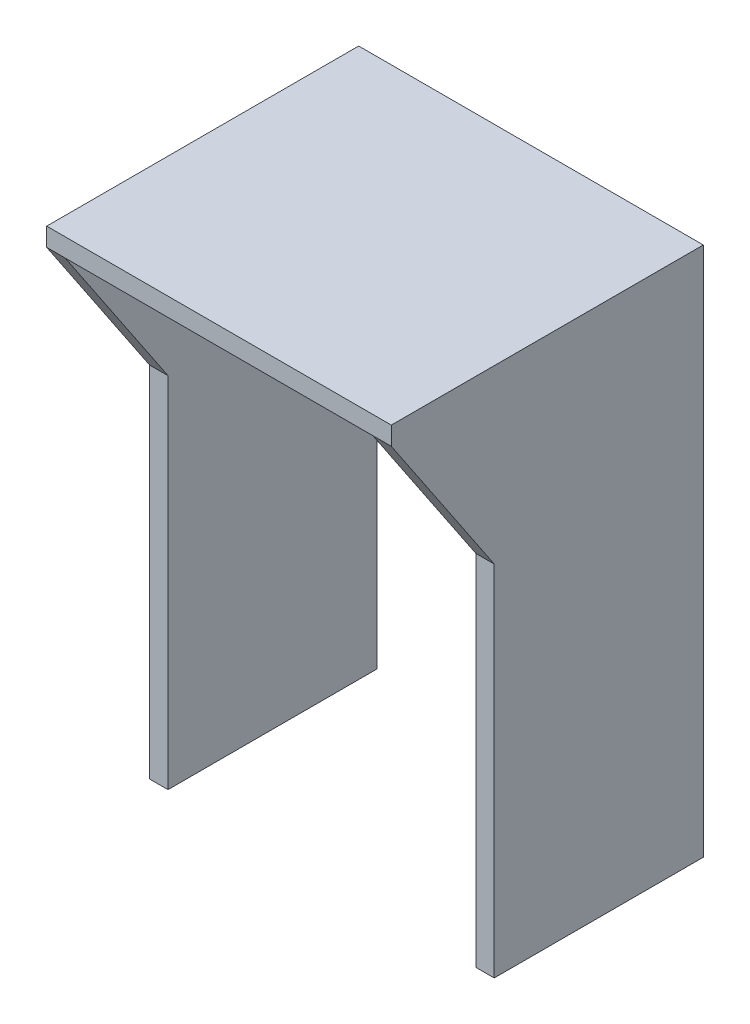
ISO-10303-21;
HEADER;
FILE_DESCRIPTION(('STEP AP214'),'2;1');
FILE_NAME('part.step','',(''),(''),'','','');
FILE_SCHEMA(('AUTOMOTIVE_DESIGN { 1 0 10303 214 1 1 1 1 }'));
ENDSEC;
DATA;
#1=APPLICATION_CONTEXT('core data for automotive mechanical design processes');
#2=APPLICATION_PROTOCOL_DEFINITION('international standard','automotive_design',2000,#1);
#3=PRODUCT_CONTEXT('',#1,'mechanical');
#4=PRODUCT('Part','Part','',(#3));
#5=PRODUCT_RELATED_PRODUCT_CATEGORY('part','',(#4));
#6=PRODUCT_DEFINITION_FORMATION('','',#4);
#7=PRODUCT_DEFINITION_CONTEXT('part definition',#1,'design');
#8=PRODUCT_DEFINITION('design','',#6,#7);
#9=PRODUCT_DEFINITION_SHAPE('','',#8);
#10=(LENGTH_UNIT() NAMED_UNIT(*) SI_UNIT(.MILLI.,.METRE.));
#11=(NAMED_UNIT(*) PLANE_ANGLE_UNIT() SI_UNIT($,.RADIAN.));
#12=(NAMED_UNIT(*) SI_UNIT($,.STERADIAN.) SOLID_ANGLE_UNIT());
#13=UNCERTAINTY_MEASURE_WITH_UNIT(LENGTH_MEASURE(1.E-05),#10,'distance_accuracy_value','');
#14=(GEOMETRIC_REPRESENTATION_CONTEXT(3) GLOBAL_UNCERTAINTY_ASSIGNED_CONTEXT((#13)) GLOBAL_UNIT_ASSIGNED_CONTEXT((#10,
#11,#12)) REPRESENTATION_CONTEXT('',''));
#15=CARTESIAN_POINT('',(0.,0.,0.));
#16=DIRECTION('',(0.,0.,1.));
#17=DIRECTION('',(1.,0.,0.));
#18=AXIS2_PLACEMENT_3D('',#15,#16,#17);
#19=CARTESIAN_POINT('',(41.2,42.8671094972797,25.));
#20=DIRECTION('',(0.,-0.557146091245593,0.830414494701144));
#21=DIRECTION('',(0.,-0.830414494701144,-0.557146091245593));
#22=AXIS2_PLACEMENT_3D('',#19,#20,#21);
#23=PLANE('',#22);
#24=DIRECTION('',(-1.,0.,0.));
#25=VECTOR('',#24,1.);
#26=CARTESIAN_POINT('',(41.2,42.8671094972797,25.));
#27=LINE('',#26,#25);
#28=CARTESIAN_POINT('',(2.2,42.8671094972797,25.));
#29=VERTEX_POINT('',#28);
#30=CARTESIAN_POINT('',(0.,42.8671094972797,25.));
#31=VERTEX_POINT('',#30);
#32=EDGE_CURVE('E123',#29,#31,#27,.T.);
#33=ORIENTED_EDGE('',*,*,#32,.F.);
#34=DIRECTION('',(0.,0.830414494701144,0.557146091245593));
#35=VECTOR('',#34,1.);
#36=CARTESIAN_POINT('',(2.2,42.8671094972797,25.));
#37=LINE('',#36,#35);
#38=CARTESIAN_POINT('',(2.2,61.2000000000008,37.3000000000024));
#39=VERTEX_POINT('',#38);
#40=EDGE_CURVE('E177',#29,#39,#37,.T.);
#41=ORIENTED_EDGE('',*,*,#40,.T.);
#42=DIRECTION('',(-1.,0.,0.));
#43=VECTOR('',#42,1.);
#44=CARTESIAN_POINT('',(41.2,61.2,37.3));
#45=LINE('',#44,#43);
#46=CARTESIAN_POINT('',(0.,61.2,37.3));
#47=VERTEX_POINT('',#46);
#48=EDGE_CURVE('E47',#39,#47,#45,.T.);
#49=ORIENTED_EDGE('',*,*,#48,.T.);
#50=DIRECTION('',(0.,0.830414494701144,0.557146091245593));
#51=VECTOR('',#50,1.);
#52=CARTESIAN_POINT('',(0.,42.8671094972797,25.));
#53=LINE('',#52,#51);
#54=EDGE_CURVE('E161',#31,#47,#53,.T.);
#55=ORIENTED_EDGE('',*,*,#54,.F.);
#56=EDGE_LOOP('',(#33,#41,#49,#55));
#57=FACE_BOUND('',#56,.T.);
#58=ADVANCED_FACE('F38',(#57),#23,.T.);
#59=CARTESIAN_POINT('',(41.2,61.2,37.3));
#60=VERTEX_POINT('',#59);
#61=CARTESIAN_POINT('',(39.,61.2000000000008,37.3000000000024));
#62=VERTEX_POINT('',#61);
#63=EDGE_CURVE('E11',#60,#62,#45,.T.);
#64=ORIENTED_EDGE('',*,*,#63,.T.);
#65=DIRECTION('',(0.,-0.830414494701144,-0.557146091245593));
#66=VECTOR('',#65,1.);
#67=CARTESIAN_POINT('',(39.,42.8671094972797,25.));
#68=LINE('',#67,#66);
#69=CARTESIAN_POINT('',(39.,42.8671094972797,25.));
#70=VERTEX_POINT('',#69);
#71=EDGE_CURVE('E188',#62,#70,#68,.T.);
#72=ORIENTED_EDGE('',*,*,#71,.T.);
#73=CARTESIAN_POINT('',(41.2,42.8671094972797,25.));
#74=VERTEX_POINT('',#73);
#75=EDGE_CURVE('E165',#74,#70,#27,.T.);
#76=ORIENTED_EDGE('',*,*,#75,.F.);
#77=DIRECTION('',(0.,0.830414494701144,0.557146091245593));
#78=VECTOR('',#77,1.);
#79=CARTESIAN_POINT('',(41.2,42.8671094972797,25.));
#80=LINE('',#79,#78);
#81=EDGE_CURVE('E133',#74,#60,#80,.T.);
#82=ORIENTED_EDGE('',*,*,#81,.T.);
#83=EDGE_LOOP('',(#64,#72,#76,#82));
#84=FACE_BOUND('',#83,.T.);
#85=ADVANCED_FACE('F248',(#84),#23,.T.);
#86=CARTESIAN_POINT('',(41.2,0.,25.));
#87=DIRECTION('',(0.,0.,1.));
#88=DIRECTION('',(1.,0.,0.));
#89=AXIS2_PLACEMENT_3D('',#86,#87,#88);
#90=PLANE('',#89);
#91=DIRECTION('',(-1.,0.,0.));
#92=VECTOR('',#91,1.);
#93=CARTESIAN_POINT('',(41.2,0.,25.));
#94=LINE('',#93,#92);
#95=CARTESIAN_POINT('',(2.20000000000001,0.,25.0000000000004));
#96=VERTEX_POINT('',#95);
#97=CARTESIAN_POINT('',(0.,0.,25.));
#98=VERTEX_POINT('',#97);
#99=EDGE_CURVE('E124',#96,#98,#94,.T.);
#100=ORIENTED_EDGE('',*,*,#99,.F.);
#101=DIRECTION('',(0.,1.,0.));
#102=VECTOR('',#101,1.);
#103=CARTESIAN_POINT('',(2.20000000000001,0.,25.));
#104=LINE('',#103,#102);
#105=EDGE_CURVE('E183',#96,#29,#104,.T.);
#106=ORIENTED_EDGE('',*,*,#105,.T.);
#107=ORIENTED_EDGE('',*,*,#32,.T.);
#108=DIRECTION('',(0.,1.,0.));
#109=VECTOR('',#108,1.);
#110=CARTESIAN_POINT('',(0.,0.,25.));
#111=LINE('',#110,#109);
#112=EDGE_CURVE('E158',#98,#31,#111,.T.);
#113=ORIENTED_EDGE('',*,*,#112,.F.);
#114=EDGE_LOOP('',(#100,#106,#107,#113));
#115=FACE_BOUND('',#114,.T.);
#116=ADVANCED_FACE('F181',(#115),#90,.T.);
#117=ORIENTED_EDGE('',*,*,#75,.T.);
#118=DIRECTION('',(0.,-1.,0.));
#119=VECTOR('',#118,1.);
#120=CARTESIAN_POINT('',(39.,0.,25.));
#121=LINE('',#120,#119);
#122=CARTESIAN_POINT('',(39.,0.,25.0000000000004));
#123=VERTEX_POINT('',#122);
#124=EDGE_CURVE('E119',#70,#123,#121,.T.);
#125=ORIENTED_EDGE('',*,*,#124,.T.);
#126=CARTESIAN_POINT('',(41.2,0.,25.));
#127=VERTEX_POINT('',#126);
#128=EDGE_CURVE('E111',#127,#123,#94,.T.);
#129=ORIENTED_EDGE('',*,*,#128,.F.);
#130=DIRECTION('',(0.,1.,0.));
#131=VECTOR('',#130,1.);
#132=CARTESIAN_POINT('',(41.2,0.,25.));
#133=LINE('',#132,#131);
#134=EDGE_CURVE('E115',#127,#74,#133,.T.);
#135=ORIENTED_EDGE('',*,*,#134,.T.);
#136=EDGE_LOOP('',(#117,#125,#129,#135));
#137=FACE_BOUND('',#136,.T.);
#138=ADVANCED_FACE('F114',(#137),#90,.T.);
#139=CARTESIAN_POINT('',(41.2,0.,0.));
#140=DIRECTION('',(0.,-1.,0.));
#141=DIRECTION('',(0.,0.,-1.));
#142=AXIS2_PLACEMENT_3D('',#139,#140,#141);
#143=PLANE('',#142);
#144=DIRECTION('',(-1.,0.,0.));
#145=VECTOR('',#144,1.);
#146=CARTESIAN_POINT('',(41.2,0.,0.));
#147=LINE('',#146,#145);
#148=CARTESIAN_POINT('',(2.20000000000001,0.,0.));
#149=VERTEX_POINT('',#148);
#150=CARTESIAN_POINT('',(0.,0.,0.));
#151=VERTEX_POINT('',#150);
#152=EDGE_CURVE('E167',#149,#151,#147,.T.);
#153=ORIENTED_EDGE('',*,*,#152,.F.);
#154=DIRECTION('',(0.,0.,-1.));
#155=VECTOR('',#154,1.);
#156=CARTESIAN_POINT('',(2.20000000000001,0.,10000.));
#157=LINE('',#156,#155);
#158=EDGE_CURVE('E206',#96,#149,#157,.T.);
#159=ORIENTED_EDGE('',*,*,#158,.F.);
#160=ORIENTED_EDGE('',*,*,#99,.T.);
#161=DIRECTION('',(0.,0.,1.));
#162=VECTOR('',#161,1.);
#163=CARTESIAN_POINT('',(0.,0.,0.));
#164=LINE('',#163,#162);
#165=EDGE_CURVE('E155',#151,#98,#164,.T.);
#166=ORIENTED_EDGE('',*,*,#165,.F.);
#167=EDGE_LOOP('',(#153,#159,#160,#166));
#168=FACE_BOUND('',#167,.T.);
#169=ADVANCED_FACE('F204',(#168),#143,.T.);
#170=ORIENTED_EDGE('',*,*,#128,.T.);
#171=DIRECTION('',(0.,0.,-1.));
#172=VECTOR('',#171,1.);
#173=CARTESIAN_POINT('',(39.,0.,10000.));
#174=LINE('',#173,#172);
#175=CARTESIAN_POINT('',(39.,0.,0.));
#176=VERTEX_POINT('',#175);
#177=EDGE_CURVE('E211',#123,#176,#174,.T.);
#178=ORIENTED_EDGE('',*,*,#177,.T.);
#179=CARTESIAN_POINT('',(41.2,0.,0.));
#180=VERTEX_POINT('',#179);
#181=EDGE_CURVE('E137',#180,#176,#147,.T.);
#182=ORIENTED_EDGE('',*,*,#181,.F.);
#183=DIRECTION('',(0.,0.,1.));
#184=VECTOR('',#183,1.);
#185=CARTESIAN_POINT('',(41.2,0.,0.));
#186=LINE('',#185,#184);
#187=EDGE_CURVE('E130',#180,#127,#186,.T.);
#188=ORIENTED_EDGE('',*,*,#187,.T.);
#189=EDGE_LOOP('',(#170,#178,#182,#188));
#190=FACE_BOUND('',#189,.T.);
#191=ADVANCED_FACE('F135',(#190),#143,.T.);
#192=CARTESIAN_POINT('',(41.2,63.4,0.));
#193=DIRECTION('',(0.,0.,-1.));
#194=DIRECTION('',(-1.,0.,0.));
#195=AXIS2_PLACEMENT_3D('',#192,#193,#194);
#196=PLANE('',#195);
#197=DIRECTION('',(-1.,0.,0.));
#198=VECTOR('',#197,1.);
#199=CARTESIAN_POINT('',(39.,61.2,0.));
#200=LINE('',#199,#198);
#201=CARTESIAN_POINT('',(39.,61.2,0.));
#202=VERTEX_POINT('',#201);
#203=CARTESIAN_POINT('',(2.2,61.2,0.));
#204=VERTEX_POINT('',#203);
#205=EDGE_CURVE('E55',#202,#204,#200,.T.);
#206=ORIENTED_EDGE('',*,*,#205,.T.);
#207=DIRECTION('',(0.,-1.,0.));
#208=VECTOR('',#207,1.);
#209=CARTESIAN_POINT('',(2.2,61.2,0.));
#210=LINE('',#209,#208);
#211=EDGE_CURVE('E220',#204,#149,#210,.T.);
#212=ORIENTED_EDGE('',*,*,#211,.T.);
#213=ORIENTED_EDGE('',*,*,#152,.T.);
#214=DIRECTION('',(0.,-1.,0.));
#215=VECTOR('',#214,1.);
#216=CARTESIAN_POINT('',(0.,63.4,0.));
#217=LINE('',#216,#215);
#218=CARTESIAN_POINT('',(0.,63.4,0.));
#219=VERTEX_POINT('',#218);
#220=EDGE_CURVE('E152',#219,#151,#217,.T.);
#221=ORIENTED_EDGE('',*,*,#220,.F.);
#222=DIRECTION('',(-1.,0.,0.));
#223=VECTOR('',#222,1.);
#224=CARTESIAN_POINT('',(41.2,63.4,0.));
#225=LINE('',#224,#223);
#226=CARTESIAN_POINT('',(41.2,63.4,0.));
#227=VERTEX_POINT('',#226);
#228=EDGE_CURVE('E168',#227,#219,#225,.T.);
#229=ORIENTED_EDGE('',*,*,#228,.F.);
#230=DIRECTION('',(0.,-1.,0.));
#231=VECTOR('',#230,1.);
#232=CARTESIAN_POINT('',(41.2,63.4,0.));
#233=LINE('',#232,#231);
#234=EDGE_CURVE('E138',#227,#180,#233,.T.);
#235=ORIENTED_EDGE('',*,*,#234,.T.);
#236=ORIENTED_EDGE('',*,*,#181,.T.);
#237=DIRECTION('',(0.,1.,0.));
#238=VECTOR('',#237,1.);
#239=CARTESIAN_POINT('',(39.,0.,0.));
#240=LINE('',#239,#238);
#241=EDGE_CURVE('E218',#176,#202,#240,.T.);
#242=ORIENTED_EDGE('',*,*,#241,.T.);
#243=EDGE_LOOP('',(#206,#212,#213,#221,#229,#235,#236,#242));
#244=FACE_BOUND('',#243,.T.);
#245=ADVANCED_FACE('F197',(#244),#196,.T.);
#246=CARTESIAN_POINT('',(41.2,61.2,37.3));
#247=DIRECTION('',(0.,0.,1.));
#248=DIRECTION('',(1.,0.,0.));
#249=AXIS2_PLACEMENT_3D('',#246,#247,#248);
#250=PLANE('',#249);
#251=DIRECTION('',(0.,1.,0.));
#252=VECTOR('',#251,1.);
#253=CARTESIAN_POINT('',(0.,61.2,37.3));
#254=LINE('',#253,#252);
#255=CARTESIAN_POINT('',(0.,63.4,37.3));
#256=VERTEX_POINT('',#255);
#257=EDGE_CURVE('E145',#47,#256,#254,.T.);
#258=ORIENTED_EDGE('',*,*,#257,.F.);
#259=ORIENTED_EDGE('',*,*,#48,.F.);
#260=DIRECTION('',(1.,0.,0.));
#261=VECTOR('',#260,1.);
#262=CARTESIAN_POINT('',(41.2,61.2,37.3));
#263=LINE('',#262,#261);
#264=EDGE_CURVE('E149',#39,#62,#263,.T.);
#265=ORIENTED_EDGE('',*,*,#264,.T.);
#266=ORIENTED_EDGE('',*,*,#63,.F.);
#267=DIRECTION('',(0.,1.,0.));
#268=VECTOR('',#267,1.);
#269=CARTESIAN_POINT('',(41.2,61.2,37.3));
#270=LINE('',#269,#268);
#271=CARTESIAN_POINT('',(41.2,63.4,37.3));
#272=VERTEX_POINT('',#271);
#273=EDGE_CURVE('E163',#60,#272,#270,.T.);
#274=ORIENTED_EDGE('',*,*,#273,.T.);
#275=DIRECTION('',(-1.,0.,0.));
#276=VECTOR('',#275,1.);
#277=CARTESIAN_POINT('',(41.2,63.4,37.3));
#278=LINE('',#277,#276);
#279=EDGE_CURVE('E42',#272,#256,#278,.T.);
#280=ORIENTED_EDGE('',*,*,#279,.T.);
#281=EDGE_LOOP('',(#258,#259,#265,#266,#274,#280));
#282=FACE_BOUND('',#281,.T.);
#283=ADVANCED_FACE('F40',(#282),#250,.T.);
#284=CARTESIAN_POINT('',(41.2,63.4,37.3));
#285=DIRECTION('',(0.,1.,0.));
#286=DIRECTION('',(0.,0.,1.));
#287=AXIS2_PLACEMENT_3D('',#284,#285,#286);
#288=PLANE('',#287);
#289=DIRECTION('',(0.,0.,-1.));
#290=VECTOR('',#289,1.);
#291=CARTESIAN_POINT('',(0.,63.4,37.3));
#292=LINE('',#291,#290);
#293=EDGE_CURVE('E148',#256,#219,#292,.T.);
#294=ORIENTED_EDGE('',*,*,#293,.F.);
#295=ORIENTED_EDGE('',*,*,#279,.F.);
#296=DIRECTION('',(0.,0.,-1.));
#297=VECTOR('',#296,1.);
#298=CARTESIAN_POINT('',(41.2,63.4,37.3));
#299=LINE('',#298,#297);
#300=EDGE_CURVE('E140',#272,#227,#299,.T.);
#301=ORIENTED_EDGE('',*,*,#300,.T.);
#302=ORIENTED_EDGE('',*,*,#228,.T.);
#303=EDGE_LOOP('',(#294,#295,#301,#302));
#304=FACE_BOUND('',#303,.T.);
#305=ADVANCED_FACE('F170',(#304),#288,.T.);
#306=CARTESIAN_POINT('',(41.2,0.,0.));
#307=DIRECTION('',(-1.,0.,0.));
#308=DIRECTION('',(0.,0.,1.));
#309=AXIS2_PLACEMENT_3D('',#306,#307,#308);
#310=PLANE('',#309);
#311=ORIENTED_EDGE('',*,*,#273,.F.);
#312=ORIENTED_EDGE('',*,*,#81,.F.);
#313=ORIENTED_EDGE('',*,*,#134,.F.);
#314=ORIENTED_EDGE('',*,*,#187,.F.);
#315=ORIENTED_EDGE('',*,*,#234,.F.);
#316=ORIENTED_EDGE('',*,*,#300,.F.);
#317=EDGE_LOOP('',(#311,#312,#313,#314,#315,#316));
#318=FACE_BOUND('',#317,.T.);
#319=ADVANCED_FACE('F128',(#318),#310,.F.);
#320=CARTESIAN_POINT('',(0.,0.,0.));
#321=DIRECTION('',(-1.,0.,0.));
#322=DIRECTION('',(0.,0.,1.));
#323=AXIS2_PLACEMENT_3D('',#320,#321,#322);
#324=PLANE('',#323);
#325=ORIENTED_EDGE('',*,*,#257,.T.);
#326=ORIENTED_EDGE('',*,*,#293,.T.);
#327=ORIENTED_EDGE('',*,*,#220,.T.);
#328=ORIENTED_EDGE('',*,*,#165,.T.);
#329=ORIENTED_EDGE('',*,*,#112,.T.);
#330=ORIENTED_EDGE('',*,*,#54,.T.);
#331=EDGE_LOOP('',(#325,#326,#327,#328,#329,#330));
#332=FACE_BOUND('',#331,.T.);
#333=ADVANCED_FACE('F172',(#332),#324,.T.);
#334=CARTESIAN_POINT('',(39.,61.2,10000.));
#335=DIRECTION('',(0.,-1.,0.));
#336=DIRECTION('',(1.,0.,0.));
#337=AXIS2_PLACEMENT_3D('',#334,#335,#336);
#338=PLANE('',#337);
#339=DIRECTION('',(0.,0.,-1.));
#340=VECTOR('',#339,1.);
#341=CARTESIAN_POINT('',(2.2,61.2,10000.));
#342=LINE('',#341,#340);
#343=EDGE_CURVE('E210',#39,#204,#342,.T.);
#344=ORIENTED_EDGE('',*,*,#343,.T.);
#345=ORIENTED_EDGE('',*,*,#205,.F.);
#346=DIRECTION('',(0.,0.,-1.));
#347=VECTOR('',#346,1.);
#348=CARTESIAN_POINT('',(39.,61.2,10000.));
#349=LINE('',#348,#347);
#350=EDGE_CURVE('E214',#62,#202,#349,.T.);
#351=ORIENTED_EDGE('',*,*,#350,.F.);
#352=ORIENTED_EDGE('',*,*,#264,.F.);
#353=EDGE_LOOP('',(#344,#345,#351,#352));
#354=FACE_BOUND('',#353,.T.);
#355=ADVANCED_FACE('F235',(#354),#338,.T.);
#356=CARTESIAN_POINT('',(2.2,61.2,10000.));
#357=DIRECTION('',(1.,0.,0.));
#358=DIRECTION('',(0.,1.,0.));
#359=AXIS2_PLACEMENT_3D('',#356,#357,#358);
#360=PLANE('',#359);
#361=ORIENTED_EDGE('',*,*,#105,.F.);
#362=ORIENTED_EDGE('',*,*,#158,.T.);
#363=ORIENTED_EDGE('',*,*,#211,.F.);
#364=ORIENTED_EDGE('',*,*,#343,.F.);
#365=ORIENTED_EDGE('',*,*,#40,.F.);
#366=EDGE_LOOP('',(#361,#362,#363,#364,#365));
#367=FACE_BOUND('',#366,.T.);
#368=ADVANCED_FACE('F236',(#367),#360,.T.);
#369=CARTESIAN_POINT('',(39.,0.,10000.));
#370=DIRECTION('',(-1.,0.,0.));
#371=DIRECTION('',(0.,0.,1.));
#372=AXIS2_PLACEMENT_3D('',#369,#370,#371);
#373=PLANE('',#372);
#374=ORIENTED_EDGE('',*,*,#350,.T.);
#375=ORIENTED_EDGE('',*,*,#241,.F.);
#376=ORIENTED_EDGE('',*,*,#177,.F.);
#377=ORIENTED_EDGE('',*,*,#124,.F.);
#378=ORIENTED_EDGE('',*,*,#71,.F.);
#379=EDGE_LOOP('',(#374,#375,#376,#377,#378));
#380=FACE_BOUND('',#379,.T.);
#381=ADVANCED_FACE('F238',(#380),#373,.T.);
#382=CLOSED_SHELL('',(#58,#85,#116,#138,#169,#191,#245,#283,#305,#319,#333,#355,#368,#381));
#383=MANIFOLD_SOLID_BREP('B2',#382);
#384=ADVANCED_BREP_SHAPE_REPRESENTATION('',(#18,#383),#14);
#385=SHAPE_DEFINITION_REPRESENTATION(#9,#384);
ENDSEC;
END-ISO-10303-21;
